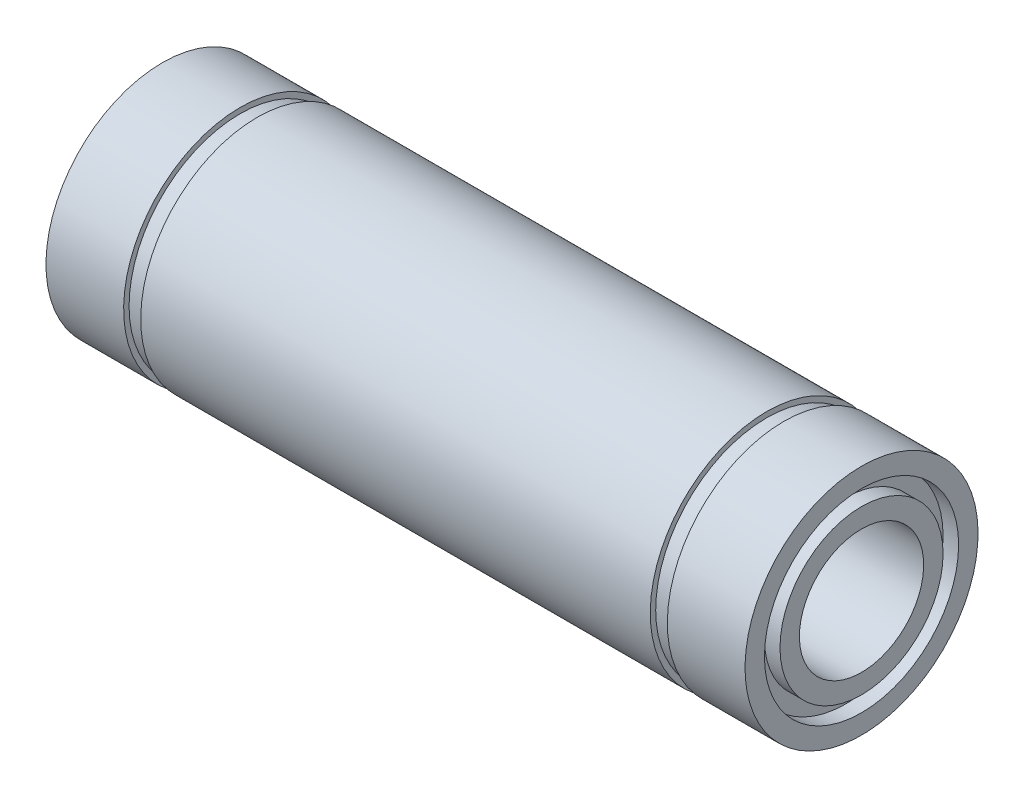
ISO-10303-21;
HEADER;
FILE_DESCRIPTION(('STEP AP214'),'2;1');
FILE_NAME('part.step','',(''),(''),'','','');
FILE_SCHEMA(('AUTOMOTIVE_DESIGN { 1 0 10303 214 1 1 1 1 }'));
ENDSEC;
DATA;
#1=APPLICATION_CONTEXT('core data for automotive mechanical design processes');
#2=APPLICATION_PROTOCOL_DEFINITION('international standard','automotive_design',2000,#1);
#3=PRODUCT_CONTEXT('',#1,'mechanical');
#4=PRODUCT('Part','Part','',(#3));
#5=PRODUCT_RELATED_PRODUCT_CATEGORY('part','',(#4));
#6=PRODUCT_DEFINITION_FORMATION('','',#4);
#7=PRODUCT_DEFINITION_CONTEXT('part definition',#1,'design');
#8=PRODUCT_DEFINITION('design','',#6,#7);
#9=PRODUCT_DEFINITION_SHAPE('','',#8);
#10=(LENGTH_UNIT() NAMED_UNIT(*) SI_UNIT(.MILLI.,.METRE.));
#11=(NAMED_UNIT(*) PLANE_ANGLE_UNIT() SI_UNIT($,.RADIAN.));
#12=(NAMED_UNIT(*) SI_UNIT($,.STERADIAN.) SOLID_ANGLE_UNIT());
#13=UNCERTAINTY_MEASURE_WITH_UNIT(LENGTH_MEASURE(1.E-05),#10,'distance_accuracy_value','');
#14=(GEOMETRIC_REPRESENTATION_CONTEXT(3) GLOBAL_UNCERTAINTY_ASSIGNED_CONTEXT((#13)) GLOBAL_UNIT_ASSIGNED_CONTEXT((#10,
#11,#12)) REPRESENTATION_CONTEXT('',''));
#15=CARTESIAN_POINT('',(0.,0.,0.));
#16=DIRECTION('',(0.,0.,1.));
#17=DIRECTION('',(1.,0.,0.));
#18=AXIS2_PLACEMENT_3D('',#15,#16,#17);
#19=CARTESIAN_POINT('',(-22.5,6.24999999999999,0.));
#20=DIRECTION('',(-1.,0.,0.));
#21=DIRECTION('',(0.,-1.,0.));
#22=AXIS2_PLACEMENT_3D('',#19,#20,#21);
#23=PLANE('',#22);
#24=CARTESIAN_POINT('',(-22.5,0.,0.));
#25=DIRECTION('',(1.,0.,0.));
#26=DIRECTION('',(0.,1.,0.));
#27=AXIS2_PLACEMENT_3D('',#24,#25,#26);
#28=CIRCLE('',#27,6.25);
#29=CARTESIAN_POINT('',(-22.5,6.24999999999999,0.));
#30=VERTEX_POINT('',#29);
#31=EDGE_CURVE('E124',#30,#30,#28,.T.);
#32=ORIENTED_EDGE('',*,*,#31,.T.);
#33=EDGE_LOOP('',(#32));
#34=FACE_BOUND('',#33,.T.);
#35=CARTESIAN_POINT('',(-22.5,0.,0.));
#36=DIRECTION('',(1.,0.,0.));
#37=DIRECTION('',(0.,1.,0.));
#38=AXIS2_PLACEMENT_3D('',#35,#36,#37);
#39=CIRCLE('',#38,7.49999999999999);
#40=CARTESIAN_POINT('',(-22.5,7.49999999999999,0.));
#41=VERTEX_POINT('',#40);
#42=EDGE_CURVE('E10',#41,#41,#39,.T.);
#43=ORIENTED_EDGE('',*,*,#42,.F.);
#44=EDGE_LOOP('',(#43));
#45=FACE_BOUND('',#44,.T.);
#46=ADVANCED_FACE('F40',(#34,#45),#23,.T.);
#47=CARTESIAN_POINT('',(0.,0.,0.));
#48=DIRECTION('',(1.,0.,0.));
#49=DIRECTION('',(0.,1.,0.));
#50=AXIS2_PLACEMENT_3D('',#47,#48,#49);
#51=CYLINDRICAL_SURFACE('',#50,7.49999999999998);
#52=ORIENTED_EDGE('',*,*,#42,.T.);
#53=EDGE_LOOP('',(#52));
#54=FACE_BOUND('',#53,.T.);
#55=CARTESIAN_POINT('',(-17.5,0.,0.));
#56=DIRECTION('',(1.,0.,0.));
#57=DIRECTION('',(0.,1.,0.));
#58=AXIS2_PLACEMENT_3D('',#55,#56,#57);
#59=CIRCLE('',#58,7.49999999999997);
#60=CARTESIAN_POINT('',(-17.5,7.49999999999997,0.));
#61=VERTEX_POINT('',#60);
#62=EDGE_CURVE('E47',#61,#61,#59,.T.);
#63=ORIENTED_EDGE('',*,*,#62,.F.);
#64=EDGE_LOOP('',(#63));
#65=FACE_BOUND('',#64,.T.);
#66=ADVANCED_FACE('F142',(#54,#65),#51,.T.);
#67=CARTESIAN_POINT('',(-17.5,7.49999999999997,0.));
#68=DIRECTION('',(1.,0.,0.));
#69=DIRECTION('',(0.,1.,0.));
#70=AXIS2_PLACEMENT_3D('',#67,#68,#69);
#71=PLANE('',#70);
#72=ORIENTED_EDGE('',*,*,#62,.T.);
#73=EDGE_LOOP('',(#72));
#74=FACE_BOUND('',#73,.T.);
#75=CARTESIAN_POINT('',(-17.5,0.,0.));
#76=DIRECTION('',(1.,0.,0.));
#77=DIRECTION('',(0.,1.,0.));
#78=AXIS2_PLACEMENT_3D('',#75,#76,#77);
#79=CIRCLE('',#78,7.15);
#80=CARTESIAN_POINT('',(-17.5,7.15,0.));
#81=VERTEX_POINT('',#80);
#82=EDGE_CURVE('E54',#81,#81,#79,.T.);
#83=ORIENTED_EDGE('',*,*,#82,.F.);
#84=EDGE_LOOP('',(#83));
#85=FACE_BOUND('',#84,.T.);
#86=ADVANCED_FACE('F146',(#74,#85),#71,.T.);
#87=CARTESIAN_POINT('',(0.,0.,0.));
#88=DIRECTION('',(1.,0.,0.));
#89=DIRECTION('',(0.,1.,0.));
#90=AXIS2_PLACEMENT_3D('',#87,#88,#89);
#91=CYLINDRICAL_SURFACE('',#90,7.15);
#92=ORIENTED_EDGE('',*,*,#82,.T.);
#93=EDGE_LOOP('',(#92));
#94=FACE_BOUND('',#93,.T.);
#95=CARTESIAN_POINT('',(-16.4,0.,0.));
#96=DIRECTION('',(1.,0.,0.));
#97=DIRECTION('',(0.,1.,0.));
#98=AXIS2_PLACEMENT_3D('',#95,#96,#97);
#99=CIRCLE('',#98,7.15);
#100=CARTESIAN_POINT('',(-16.4,7.15,0.));
#101=VERTEX_POINT('',#100);
#102=EDGE_CURVE('E61',#101,#101,#99,.T.);
#103=ORIENTED_EDGE('',*,*,#102,.F.);
#104=EDGE_LOOP('',(#103));
#105=FACE_BOUND('',#104,.T.);
#106=ADVANCED_FACE('F150',(#94,#105),#91,.T.);
#107=CARTESIAN_POINT('',(-16.4,7.15,0.));
#108=DIRECTION('',(-1.,0.,0.));
#109=DIRECTION('',(0.,-1.,0.));
#110=AXIS2_PLACEMENT_3D('',#107,#108,#109);
#111=PLANE('',#110);
#112=ORIENTED_EDGE('',*,*,#102,.T.);
#113=EDGE_LOOP('',(#112));
#114=FACE_BOUND('',#113,.T.);
#115=CARTESIAN_POINT('',(-16.4,0.,0.));
#116=DIRECTION('',(1.,0.,0.));
#117=DIRECTION('',(0.,1.,0.));
#118=AXIS2_PLACEMENT_3D('',#115,#116,#117);
#119=CIRCLE('',#118,7.49999999999997);
#120=CARTESIAN_POINT('',(-16.4,7.49999999999997,0.));
#121=VERTEX_POINT('',#120);
#122=EDGE_CURVE('E67',#121,#121,#119,.T.);
#123=ORIENTED_EDGE('',*,*,#122,.F.);
#124=EDGE_LOOP('',(#123));
#125=FACE_BOUND('',#124,.T.);
#126=ADVANCED_FACE('F156',(#114,#125),#111,.T.);
#127=CARTESIAN_POINT('',(0.,0.,0.));
#128=DIRECTION('',(1.,0.,0.));
#129=DIRECTION('',(0.,1.,0.));
#130=AXIS2_PLACEMENT_3D('',#127,#128,#129);
#131=CYLINDRICAL_SURFACE('',#130,7.49999999999997);
#132=ORIENTED_EDGE('',*,*,#122,.T.);
#133=EDGE_LOOP('',(#132));
#134=FACE_BOUND('',#133,.T.);
#135=CARTESIAN_POINT('',(16.4,0.,0.));
#136=DIRECTION('',(1.,0.,0.));
#137=DIRECTION('',(0.,1.,0.));
#138=AXIS2_PLACEMENT_3D('',#135,#136,#137);
#139=CIRCLE('',#138,7.49999999999997);
#140=CARTESIAN_POINT('',(16.4,7.49999999999997,0.));
#141=VERTEX_POINT('',#140);
#142=EDGE_CURVE('E70',#141,#141,#139,.T.);
#143=ORIENTED_EDGE('',*,*,#142,.F.);
#144=EDGE_LOOP('',(#143));
#145=FACE_BOUND('',#144,.T.);
#146=ADVANCED_FACE('F160',(#134,#145),#131,.T.);
#147=CARTESIAN_POINT('',(16.4,7.49999999999997,0.));
#148=DIRECTION('',(1.,0.,0.));
#149=DIRECTION('',(0.,1.,0.));
#150=AXIS2_PLACEMENT_3D('',#147,#148,#149);
#151=PLANE('',#150);
#152=ORIENTED_EDGE('',*,*,#142,.T.);
#153=EDGE_LOOP('',(#152));
#154=FACE_BOUND('',#153,.T.);
#155=CARTESIAN_POINT('',(16.4,0.,0.));
#156=DIRECTION('',(1.,0.,0.));
#157=DIRECTION('',(0.,1.,0.));
#158=AXIS2_PLACEMENT_3D('',#155,#156,#157);
#159=CIRCLE('',#158,7.15);
#160=CARTESIAN_POINT('',(16.4,7.15,0.));
#161=VERTEX_POINT('',#160);
#162=EDGE_CURVE('E74',#161,#161,#159,.T.);
#163=ORIENTED_EDGE('',*,*,#162,.F.);
#164=EDGE_LOOP('',(#163));
#165=FACE_BOUND('',#164,.T.);
#166=ADVANCED_FACE('F164',(#154,#165),#151,.T.);
#167=CARTESIAN_POINT('',(0.,0.,0.));
#168=DIRECTION('',(1.,0.,0.));
#169=DIRECTION('',(0.,1.,0.));
#170=AXIS2_PLACEMENT_3D('',#167,#168,#169);
#171=CYLINDRICAL_SURFACE('',#170,7.15);
#172=ORIENTED_EDGE('',*,*,#162,.T.);
#173=EDGE_LOOP('',(#172));
#174=FACE_BOUND('',#173,.T.);
#175=CARTESIAN_POINT('',(17.5,0.,0.));
#176=DIRECTION('',(1.,0.,0.));
#177=DIRECTION('',(0.,1.,0.));
#178=AXIS2_PLACEMENT_3D('',#175,#176,#177);
#179=CIRCLE('',#178,7.15);
#180=CARTESIAN_POINT('',(17.5,7.15,0.));
#181=VERTEX_POINT('',#180);
#182=EDGE_CURVE('E78',#181,#181,#179,.T.);
#183=ORIENTED_EDGE('',*,*,#182,.F.);
#184=EDGE_LOOP('',(#183));
#185=FACE_BOUND('',#184,.T.);
#186=ADVANCED_FACE('F168',(#174,#185),#171,.T.);
#187=CARTESIAN_POINT('',(17.5,7.15,0.));
#188=DIRECTION('',(-1.,0.,0.));
#189=DIRECTION('',(0.,-1.,0.));
#190=AXIS2_PLACEMENT_3D('',#187,#188,#189);
#191=PLANE('',#190);
#192=ORIENTED_EDGE('',*,*,#182,.T.);
#193=EDGE_LOOP('',(#192));
#194=FACE_BOUND('',#193,.T.);
#195=CARTESIAN_POINT('',(17.5,0.,0.));
#196=DIRECTION('',(1.,0.,0.));
#197=DIRECTION('',(0.,1.,0.));
#198=AXIS2_PLACEMENT_3D('',#195,#196,#197);
#199=CIRCLE('',#198,7.49999999999997);
#200=CARTESIAN_POINT('',(17.5,7.49999999999997,0.));
#201=VERTEX_POINT('',#200);
#202=EDGE_CURVE('E82',#201,#201,#199,.T.);
#203=ORIENTED_EDGE('',*,*,#202,.F.);
#204=EDGE_LOOP('',(#203));
#205=FACE_BOUND('',#204,.T.);
#206=ADVANCED_FACE('F172',(#194,#205),#191,.T.);
#207=CARTESIAN_POINT('',(0.,0.,0.));
#208=DIRECTION('',(1.,0.,0.));
#209=DIRECTION('',(0.,1.,0.));
#210=AXIS2_PLACEMENT_3D('',#207,#208,#209);
#211=CYLINDRICAL_SURFACE('',#210,7.49999999999996);
#212=ORIENTED_EDGE('',*,*,#202,.T.);
#213=EDGE_LOOP('',(#212));
#214=FACE_BOUND('',#213,.T.);
#215=CARTESIAN_POINT('',(22.5,0.,0.));
#216=DIRECTION('',(1.,0.,0.));
#217=DIRECTION('',(0.,1.,0.));
#218=AXIS2_PLACEMENT_3D('',#215,#216,#217);
#219=CIRCLE('',#218,7.49999999999995);
#220=CARTESIAN_POINT('',(22.5,7.49999999999995,0.));
#221=VERTEX_POINT('',#220);
#222=EDGE_CURVE('E86',#221,#221,#219,.T.);
#223=ORIENTED_EDGE('',*,*,#222,.F.);
#224=EDGE_LOOP('',(#223));
#225=FACE_BOUND('',#224,.T.);
#226=ADVANCED_FACE('F176',(#214,#225),#211,.T.);
#227=CARTESIAN_POINT('',(22.5,7.49999999999995,0.));
#228=DIRECTION('',(1.,0.,0.));
#229=DIRECTION('',(0.,1.,0.));
#230=AXIS2_PLACEMENT_3D('',#227,#228,#229);
#231=PLANE('',#230);
#232=ORIENTED_EDGE('',*,*,#222,.T.);
#233=EDGE_LOOP('',(#232));
#234=FACE_BOUND('',#233,.T.);
#235=CARTESIAN_POINT('',(22.5,0.,0.));
#236=DIRECTION('',(1.,0.,0.));
#237=DIRECTION('',(0.,1.,0.));
#238=AXIS2_PLACEMENT_3D('',#235,#236,#237);
#239=CIRCLE('',#238,6.24999999999997);
#240=CARTESIAN_POINT('',(22.5,6.24999999999997,0.));
#241=VERTEX_POINT('',#240);
#242=EDGE_CURVE('E90',#241,#241,#239,.T.);
#243=ORIENTED_EDGE('',*,*,#242,.F.);
#244=EDGE_LOOP('',(#243));
#245=FACE_BOUND('',#244,.T.);
#246=ADVANCED_FACE('F180',(#234,#245),#231,.T.);
#247=CARTESIAN_POINT('',(0.,0.,0.));
#248=DIRECTION('',(1.,0.,0.));
#249=DIRECTION('',(0.,1.,0.));
#250=AXIS2_PLACEMENT_3D('',#247,#248,#249);
#251=CYLINDRICAL_SURFACE('',#250,6.24999999999997);
#252=ORIENTED_EDGE('',*,*,#242,.T.);
#253=EDGE_LOOP('',(#252));
#254=FACE_BOUND('',#253,.T.);
#255=CARTESIAN_POINT('',(21.5,0.,0.));
#256=DIRECTION('',(1.,0.,0.));
#257=DIRECTION('',(0.,1.,0.));
#258=AXIS2_PLACEMENT_3D('',#255,#256,#257);
#259=CIRCLE('',#258,6.24999999999997);
#260=CARTESIAN_POINT('',(21.5,6.24999999999997,0.));
#261=VERTEX_POINT('',#260);
#262=EDGE_CURVE('E94',#261,#261,#259,.T.);
#263=ORIENTED_EDGE('',*,*,#262,.F.);
#264=EDGE_LOOP('',(#263));
#265=FACE_BOUND('',#264,.T.);
#266=ADVANCED_FACE('F184',(#254,#265),#251,.F.);
#267=CARTESIAN_POINT('',(21.5,6.24999999999997,0.));
#268=DIRECTION('',(1.,0.,0.));
#269=DIRECTION('',(0.,1.,0.));
#270=AXIS2_PLACEMENT_3D('',#267,#268,#269);
#271=PLANE('',#270);
#272=ORIENTED_EDGE('',*,*,#262,.T.);
#273=EDGE_LOOP('',(#272));
#274=FACE_BOUND('',#273,.T.);
#275=CARTESIAN_POINT('',(21.5,0.,0.));
#276=DIRECTION('',(1.,0.,0.));
#277=DIRECTION('',(0.,1.,0.));
#278=AXIS2_PLACEMENT_3D('',#275,#276,#277);
#279=CIRCLE('',#278,5.24999999999997);
#280=CARTESIAN_POINT('',(21.5,5.24999999999997,0.));
#281=VERTEX_POINT('',#280);
#282=EDGE_CURVE('E98',#281,#281,#279,.T.);
#283=ORIENTED_EDGE('',*,*,#282,.F.);
#284=EDGE_LOOP('',(#283));
#285=FACE_BOUND('',#284,.T.);
#286=ADVANCED_FACE('F188',(#274,#285),#271,.T.);
#287=CARTESIAN_POINT('',(0.,0.,0.));
#288=DIRECTION('',(1.,0.,0.));
#289=DIRECTION('',(0.,1.,0.));
#290=AXIS2_PLACEMENT_3D('',#287,#288,#289);
#291=CYLINDRICAL_SURFACE('',#290,5.24999999999997);
#292=ORIENTED_EDGE('',*,*,#282,.T.);
#293=EDGE_LOOP('',(#292));
#294=FACE_BOUND('',#293,.T.);
#295=CARTESIAN_POINT('',(22.5,0.,0.));
#296=DIRECTION('',(1.,0.,0.));
#297=DIRECTION('',(0.,1.,0.));
#298=AXIS2_PLACEMENT_3D('',#295,#296,#297);
#299=CIRCLE('',#298,5.24999999999997);
#300=CARTESIAN_POINT('',(22.5,5.24999999999997,0.));
#301=VERTEX_POINT('',#300);
#302=EDGE_CURVE('E101',#301,#301,#299,.T.);
#303=ORIENTED_EDGE('',*,*,#302,.F.);
#304=EDGE_LOOP('',(#303));
#305=FACE_BOUND('',#304,.T.);
#306=ADVANCED_FACE('F192',(#294,#305),#291,.T.);
#307=CARTESIAN_POINT('',(22.5,5.24999999999997,0.));
#308=DIRECTION('',(1.,0.,0.));
#309=DIRECTION('',(0.,1.,0.));
#310=AXIS2_PLACEMENT_3D('',#307,#308,#309);
#311=PLANE('',#310);
#312=ORIENTED_EDGE('',*,*,#302,.T.);
#313=EDGE_LOOP('',(#312));
#314=FACE_BOUND('',#313,.T.);
#315=CARTESIAN_POINT('',(22.5,0.,0.));
#316=DIRECTION('',(1.,0.,0.));
#317=DIRECTION('',(0.,1.,0.));
#318=AXIS2_PLACEMENT_3D('',#315,#316,#317);
#319=CIRCLE('',#318,3.99999999999999);
#320=CARTESIAN_POINT('',(22.5,3.99999999999999,0.));
#321=VERTEX_POINT('',#320);
#322=EDGE_CURVE('E105',#321,#321,#319,.T.);
#323=ORIENTED_EDGE('',*,*,#322,.F.);
#324=EDGE_LOOP('',(#323));
#325=FACE_BOUND('',#324,.T.);
#326=ADVANCED_FACE('F196',(#314,#325),#311,.T.);
#327=CARTESIAN_POINT('',(0.,0.,0.));
#328=DIRECTION('',(1.,0.,0.));
#329=DIRECTION('',(0.,1.,0.));
#330=AXIS2_PLACEMENT_3D('',#327,#328,#329);
#331=CYLINDRICAL_SURFACE('',#330,3.99999999999999);
#332=ORIENTED_EDGE('',*,*,#322,.T.);
#333=EDGE_LOOP('',(#332));
#334=FACE_BOUND('',#333,.T.);
#335=CARTESIAN_POINT('',(-22.5,0.,0.));
#336=DIRECTION('',(1.,0.,0.));
#337=DIRECTION('',(0.,1.,0.));
#338=AXIS2_PLACEMENT_3D('',#335,#336,#337);
#339=CIRCLE('',#338,3.99999999999999);
#340=CARTESIAN_POINT('',(-22.5,3.99999999999999,0.));
#341=VERTEX_POINT('',#340);
#342=EDGE_CURVE('E108',#341,#341,#339,.T.);
#343=ORIENTED_EDGE('',*,*,#342,.F.);
#344=EDGE_LOOP('',(#343));
#345=FACE_BOUND('',#344,.T.);
#346=ADVANCED_FACE('F200',(#334,#345),#331,.F.);
#347=CARTESIAN_POINT('',(-22.5,3.99999999999999,0.));
#348=DIRECTION('',(-1.,0.,0.));
#349=DIRECTION('',(0.,-1.,0.));
#350=AXIS2_PLACEMENT_3D('',#347,#348,#349);
#351=PLANE('',#350);
#352=ORIENTED_EDGE('',*,*,#342,.T.);
#353=EDGE_LOOP('',(#352));
#354=FACE_BOUND('',#353,.T.);
#355=CARTESIAN_POINT('',(-22.5,0.,0.));
#356=DIRECTION('',(1.,0.,0.));
#357=DIRECTION('',(0.,1.,0.));
#358=AXIS2_PLACEMENT_3D('',#355,#356,#357);
#359=CIRCLE('',#358,5.25);
#360=CARTESIAN_POINT('',(-22.5,5.24999999999999,0.));
#361=VERTEX_POINT('',#360);
#362=EDGE_CURVE('E112',#361,#361,#359,.T.);
#363=ORIENTED_EDGE('',*,*,#362,.F.);
#364=EDGE_LOOP('',(#363));
#365=FACE_BOUND('',#364,.T.);
#366=ADVANCED_FACE('F204',(#354,#365),#351,.T.);
#367=CARTESIAN_POINT('',(0.,0.,0.));
#368=DIRECTION('',(1.,0.,0.));
#369=DIRECTION('',(0.,1.,0.));
#370=AXIS2_PLACEMENT_3D('',#367,#368,#369);
#371=CYLINDRICAL_SURFACE('',#370,5.25);
#372=ORIENTED_EDGE('',*,*,#362,.T.);
#373=EDGE_LOOP('',(#372));
#374=FACE_BOUND('',#373,.T.);
#375=CARTESIAN_POINT('',(-21.5,0.,0.));
#376=DIRECTION('',(1.,0.,0.));
#377=DIRECTION('',(0.,1.,0.));
#378=AXIS2_PLACEMENT_3D('',#375,#376,#377);
#379=CIRCLE('',#378,5.25);
#380=CARTESIAN_POINT('',(-21.5,5.24999999999999,0.));
#381=VERTEX_POINT('',#380);
#382=EDGE_CURVE('E116',#381,#381,#379,.T.);
#383=ORIENTED_EDGE('',*,*,#382,.F.);
#384=EDGE_LOOP('',(#383));
#385=FACE_BOUND('',#384,.T.);
#386=ADVANCED_FACE('F138',(#374,#385),#371,.T.);
#387=CARTESIAN_POINT('',(-21.5,6.24999999999999,0.));
#388=DIRECTION('',(-1.,0.,0.));
#389=DIRECTION('',(0.,-1.,0.));
#390=AXIS2_PLACEMENT_3D('',#387,#388,#389);
#391=PLANE('',#390);
#392=ORIENTED_EDGE('',*,*,#382,.T.);
#393=EDGE_LOOP('',(#392));
#394=FACE_BOUND('',#393,.T.);
#395=CARTESIAN_POINT('',(-21.5,0.,0.));
#396=DIRECTION('',(1.,0.,0.));
#397=DIRECTION('',(0.,1.,0.));
#398=AXIS2_PLACEMENT_3D('',#395,#396,#397);
#399=CIRCLE('',#398,6.25);
#400=CARTESIAN_POINT('',(-21.5,6.24999999999999,0.));
#401=VERTEX_POINT('',#400);
#402=EDGE_CURVE('E120',#401,#401,#399,.T.);
#403=ORIENTED_EDGE('',*,*,#402,.F.);
#404=EDGE_LOOP('',(#403));
#405=FACE_BOUND('',#404,.T.);
#406=ADVANCED_FACE('F132',(#394,#405),#391,.T.);
#407=CARTESIAN_POINT('',(0.,0.,0.));
#408=DIRECTION('',(1.,0.,0.));
#409=DIRECTION('',(0.,1.,0.));
#410=AXIS2_PLACEMENT_3D('',#407,#408,#409);
#411=CYLINDRICAL_SURFACE('',#410,6.25);
#412=ORIENTED_EDGE('',*,*,#402,.T.);
#413=EDGE_LOOP('',(#412));
#414=FACE_BOUND('',#413,.T.);
#415=ORIENTED_EDGE('',*,*,#31,.F.);
#416=EDGE_LOOP('',(#415));
#417=FACE_BOUND('',#416,.T.);
#418=ADVANCED_FACE('F130',(#414,#417),#411,.F.);
#419=CLOSED_SHELL('',(#46,#66,#86,#106,#126,#146,#166,#186,#206,#226,#246,#266,#286,#306,#326,
#346,#366,#386,#406,#418));
#420=MANIFOLD_SOLID_BREP('B2',#419);
#421=ADVANCED_BREP_SHAPE_REPRESENTATION('',(#18,#420),#14);
#422=SHAPE_DEFINITION_REPRESENTATION(#9,#421);
ENDSEC;
END-ISO-10303-21;
